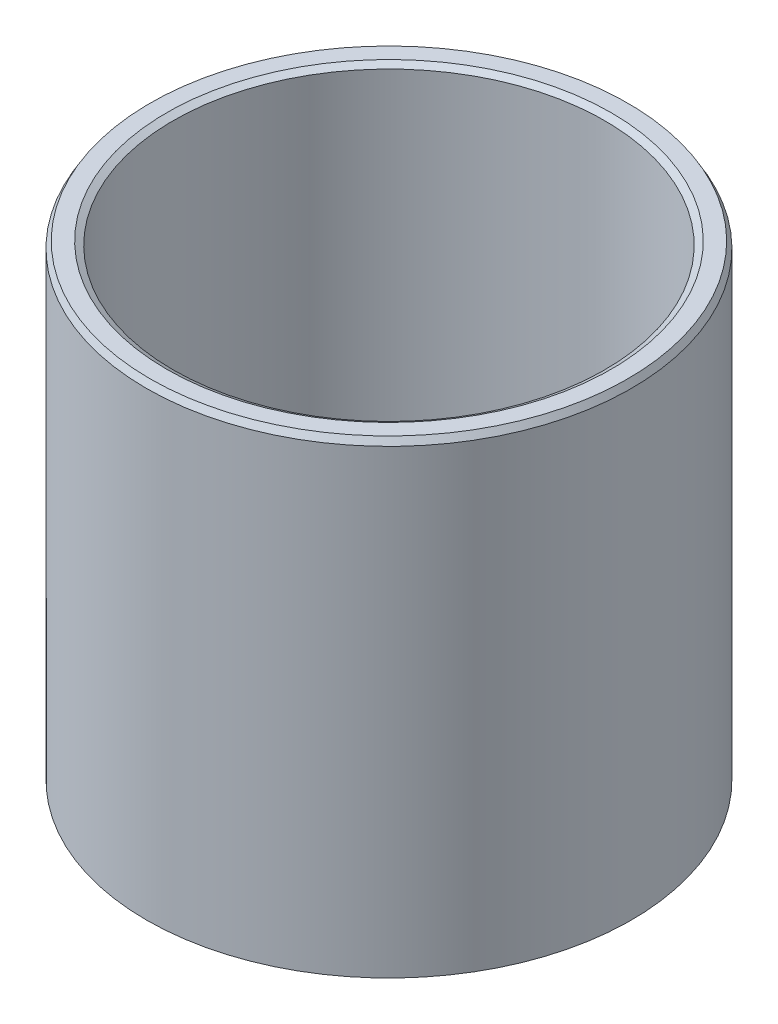
ISO-10303-21;
HEADER;
FILE_DESCRIPTION(('STEP AP214'),'2;1');
FILE_NAME('part.step','',(''),(''),'','','');
FILE_SCHEMA(('AUTOMOTIVE_DESIGN { 1 0 10303 214 1 1 1 1 }'));
ENDSEC;
DATA;
#1=APPLICATION_CONTEXT('core data for automotive mechanical design processes');
#2=APPLICATION_PROTOCOL_DEFINITION('international standard','automotive_design',2000,#1);
#3=PRODUCT_CONTEXT('',#1,'mechanical');
#4=PRODUCT('Part','Part','',(#3));
#5=PRODUCT_RELATED_PRODUCT_CATEGORY('part','',(#4));
#6=PRODUCT_DEFINITION_FORMATION('','',#4);
#7=PRODUCT_DEFINITION_CONTEXT('part definition',#1,'design');
#8=PRODUCT_DEFINITION('design','',#6,#7);
#9=PRODUCT_DEFINITION_SHAPE('','',#8);
#10=(LENGTH_UNIT() NAMED_UNIT(*) SI_UNIT(.MILLI.,.METRE.));
#11=(NAMED_UNIT(*) PLANE_ANGLE_UNIT() SI_UNIT($,.RADIAN.));
#12=(NAMED_UNIT(*) SI_UNIT($,.STERADIAN.) SOLID_ANGLE_UNIT());
#13=UNCERTAINTY_MEASURE_WITH_UNIT(LENGTH_MEASURE(1.E-05),#10,'distance_accuracy_value','');
#14=(GEOMETRIC_REPRESENTATION_CONTEXT(3) GLOBAL_UNCERTAINTY_ASSIGNED_CONTEXT((#13)) GLOBAL_UNIT_ASSIGNED_CONTEXT((#10,
#11,#12)) REPRESENTATION_CONTEXT('',''));
#15=CARTESIAN_POINT('',(0.,0.,0.));
#16=DIRECTION('',(0.,0.,1.));
#17=DIRECTION('',(1.,0.,0.));
#18=AXIS2_PLACEMENT_3D('',#15,#16,#17);
#19=CARTESIAN_POINT('',(0.,106.715641324511,0.));
#20=DIRECTION('',(0.,-1.,0.));
#21=DIRECTION('',(0.,0.,-1.));
#22=AXIS2_PLACEMENT_3D('',#19,#20,#21);
#23=CYLINDRICAL_SURFACE('',#22,55.);
#24=CARTESIAN_POINT('',(0.,0.840243522066714,0.));
#25=DIRECTION('',(0.,1.,0.));
#26=DIRECTION('',(0.,0.,1.));
#27=AXIS2_PLACEMENT_3D('',#24,#25,#26);
#28=CIRCLE('',#27,55.);
#29=CARTESIAN_POINT('',(0.,0.840243522066714,55.));
#30=VERTEX_POINT('',#29);
#31=EDGE_CURVE('E10',#30,#30,#28,.T.);
#32=ORIENTED_EDGE('',*,*,#31,.T.);
#33=EDGE_LOOP('',(#32));
#34=FACE_BOUND('',#33,.T.);
#35=CARTESIAN_POINT('',(0.,105.260296853561,0.));
#36=DIRECTION('',(0.,1.,0.));
#37=DIRECTION('',(0.,0.,1.));
#38=AXIS2_PLACEMENT_3D('',#35,#36,#37);
#39=CIRCLE('',#38,55.);
#40=CARTESIAN_POINT('',(0.,105.260296853561,55.));
#41=VERTEX_POINT('',#40);
#42=EDGE_CURVE('E50',#41,#41,#39,.F.);
#43=ORIENTED_EDGE('',*,*,#42,.T.);
#44=EDGE_LOOP('',(#43));
#45=FACE_BOUND('',#44,.T.);
#46=ADVANCED_FACE('F39',(#34,#45),#23,.T.);
#47=CARTESIAN_POINT('',(0.,106.715641324511,0.));
#48=DIRECTION('',(0.,1.,0.));
#49=DIRECTION('',(0.,0.,1.));
#50=AXIS2_PLACEMENT_3D('',#47,#48,#49);
#51=PLANE('',#50);
#52=CARTESIAN_POINT('',(0.,106.715641324511,0.));
#53=DIRECTION('',(0.,1.,0.));
#54=DIRECTION('',(0.,0.,1.));
#55=AXIS2_PLACEMENT_3D('',#52,#53,#54);
#56=CIRCLE('',#55,50.4042539918995);
#57=CARTESIAN_POINT('',(0.,106.715641324511,50.4042539918995));
#58=VERTEX_POINT('',#57);
#59=EDGE_CURVE('E58',#58,#58,#56,.F.);
#60=ORIENTED_EDGE('',*,*,#59,.T.);
#61=EDGE_LOOP('',(#60));
#62=FACE_BOUND('',#61,.T.);
#63=CARTESIAN_POINT('',(0.,106.715641324511,0.));
#64=DIRECTION('',(0.,1.,0.));
#65=DIRECTION('',(0.,0.,1.));
#66=AXIS2_PLACEMENT_3D('',#63,#64,#65);
#67=CIRCLE('',#66,54.1597564779333);
#68=CARTESIAN_POINT('',(0.,106.715641324511,54.1597564779333));
#69=VERTEX_POINT('',#68);
#70=EDGE_CURVE('E61',#69,#69,#67,.T.);
#71=ORIENTED_EDGE('',*,*,#70,.T.);
#72=EDGE_LOOP('',(#71));
#73=FACE_BOUND('',#72,.T.);
#74=ADVANCED_FACE('F88',(#62,#73),#51,.T.);
#75=CARTESIAN_POINT('',(0.,0.,0.));
#76=DIRECTION('',(0.,1.,0.));
#77=DIRECTION('',(0.,0.,1.));
#78=AXIS2_PLACEMENT_3D('',#75,#76,#77);
#79=PLANE('',#78);
#80=CARTESIAN_POINT('',(0.,0.,0.));
#81=DIRECTION('',(0.,1.,0.));
#82=DIRECTION('',(0.,0.,1.));
#83=AXIS2_PLACEMENT_3D('',#80,#81,#82);
#84=CIRCLE('',#83,49.789153043016);
#85=CARTESIAN_POINT('',(0.,0.,49.789153043016));
#86=VERTEX_POINT('',#85);
#87=EDGE_CURVE('E51',#86,#86,#84,.T.);
#88=ORIENTED_EDGE('',*,*,#87,.T.);
#89=EDGE_LOOP('',(#88));
#90=FACE_BOUND('',#89,.T.);
#91=CARTESIAN_POINT('',(0.,0.,0.));
#92=DIRECTION('',(0.,1.,0.));
#93=DIRECTION('',(0.,0.,1.));
#94=AXIS2_PLACEMENT_3D('',#91,#92,#93);
#95=CIRCLE('',#94,53.5446555290498);
#96=CARTESIAN_POINT('',(0.,0.,53.5446555290498));
#97=VERTEX_POINT('',#96);
#98=EDGE_CURVE('E54',#97,#97,#95,.F.);
#99=ORIENTED_EDGE('',*,*,#98,.T.);
#100=EDGE_LOOP('',(#99));
#101=FACE_BOUND('',#100,.T.);
#102=ADVANCED_FACE('F83',(#90,#101),#79,.F.);
#103=CARTESIAN_POINT('',(0.,106.715641324511,0.));
#104=DIRECTION('',(0.,-1.,0.));
#105=DIRECTION('',(0.,0.,-1.));
#106=AXIS2_PLACEMENT_3D('',#103,#104,#105);
#107=CYLINDRICAL_SURFACE('',#106,48.9489095209493);
#108=CARTESIAN_POINT('',(0.,105.875397802444,0.));
#109=DIRECTION('',(0.,1.,0.));
#110=DIRECTION('',(0.,0.,1.));
#111=AXIS2_PLACEMENT_3D('',#108,#109,#110);
#112=CIRCLE('',#111,48.9489095209493);
#113=CARTESIAN_POINT('',(0.,105.875397802444,48.9489095209493));
#114=VERTEX_POINT('',#113);
#115=EDGE_CURVE('E67',#114,#114,#112,.T.);
#116=ORIENTED_EDGE('',*,*,#115,.T.);
#117=EDGE_LOOP('',(#116));
#118=FACE_BOUND('',#117,.T.);
#119=CARTESIAN_POINT('',(0.,1.45534447095018,0.));
#120=DIRECTION('',(0.,1.,0.));
#121=DIRECTION('',(0.,0.,1.));
#122=AXIS2_PLACEMENT_3D('',#119,#120,#121);
#123=CIRCLE('',#122,48.9489095209493);
#124=CARTESIAN_POINT('',(0.,1.45534447095018,48.9489095209493));
#125=VERTEX_POINT('',#124);
#126=EDGE_CURVE('E69',#125,#125,#123,.F.);
#127=ORIENTED_EDGE('',*,*,#126,.T.);
#128=EDGE_LOOP('',(#127));
#129=FACE_BOUND('',#128,.T.);
#130=ADVANCED_FACE('F71',(#118,#129),#107,.F.);
#131=CARTESIAN_POINT('',(0.,105.875397802444,0.));
#132=DIRECTION('',(0.,1.,0.));
#133=DIRECTION('',(0.,0.,1.));
#134=AXIS2_PLACEMENT_3D('',#131,#132,#133);
#135=CONICAL_SURFACE('',#134,48.9489095209493,1.04719755119659);
#136=ORIENTED_EDGE('',*,*,#59,.F.);
#137=EDGE_LOOP('',(#136));
#138=FACE_BOUND('',#137,.T.);
#139=ORIENTED_EDGE('',*,*,#115,.F.);
#140=EDGE_LOOP('',(#139));
#141=FACE_BOUND('',#140,.T.);
#142=ADVANCED_FACE('F77',(#138,#141),#135,.F.);
#143=CARTESIAN_POINT('',(0.,0.,0.));
#144=DIRECTION('',(0.,-1.,0.));
#145=DIRECTION('',(0.,0.,-1.));
#146=AXIS2_PLACEMENT_3D('',#143,#144,#145);
#147=CONICAL_SURFACE('',#146,49.789153043016,0.523598775598292);
#148=ORIENTED_EDGE('',*,*,#126,.F.);
#149=EDGE_LOOP('',(#148));
#150=FACE_BOUND('',#149,.T.);
#151=ORIENTED_EDGE('',*,*,#87,.F.);
#152=EDGE_LOOP('',(#151));
#153=FACE_BOUND('',#152,.T.);
#154=ADVANCED_FACE('F73',(#150,#153),#147,.F.);
#155=CARTESIAN_POINT('',(0.,0.840243522066714,0.));
#156=DIRECTION('',(0.,1.,0.));
#157=DIRECTION('',(0.,0.,1.));
#158=AXIS2_PLACEMENT_3D('',#155,#156,#157);
#159=CONICAL_SURFACE('',#158,55.,1.0471975511966);
#160=ORIENTED_EDGE('',*,*,#98,.F.);
#161=EDGE_LOOP('',(#160));
#162=FACE_BOUND('',#161,.T.);
#163=ORIENTED_EDGE('',*,*,#31,.F.);
#164=EDGE_LOOP('',(#163));
#165=FACE_BOUND('',#164,.T.);
#166=ADVANCED_FACE('F76',(#162,#165),#159,.T.);
#167=CARTESIAN_POINT('',(0.,106.715641324511,0.));
#168=DIRECTION('',(0.,-1.,0.));
#169=DIRECTION('',(0.,0.,-1.));
#170=AXIS2_PLACEMENT_3D('',#167,#168,#169);
#171=CONICAL_SURFACE('',#170,54.1597564779333,0.523598775598304);
#172=ORIENTED_EDGE('',*,*,#42,.F.);
#173=EDGE_LOOP('',(#172));
#174=FACE_BOUND('',#173,.T.);
#175=ORIENTED_EDGE('',*,*,#70,.F.);
#176=EDGE_LOOP('',(#175));
#177=FACE_BOUND('',#176,.T.);
#178=ADVANCED_FACE('F45',(#174,#177),#171,.T.);
#179=CLOSED_SHELL('',(#46,#74,#102,#130,#142,#154,#166,#178));
#180=MANIFOLD_SOLID_BREP('B2',#179);
#181=ADVANCED_BREP_SHAPE_REPRESENTATION('',(#18,#180),#14);
#182=SHAPE_DEFINITION_REPRESENTATION(#9,#181);
ENDSEC;
END-ISO-10303-21;
